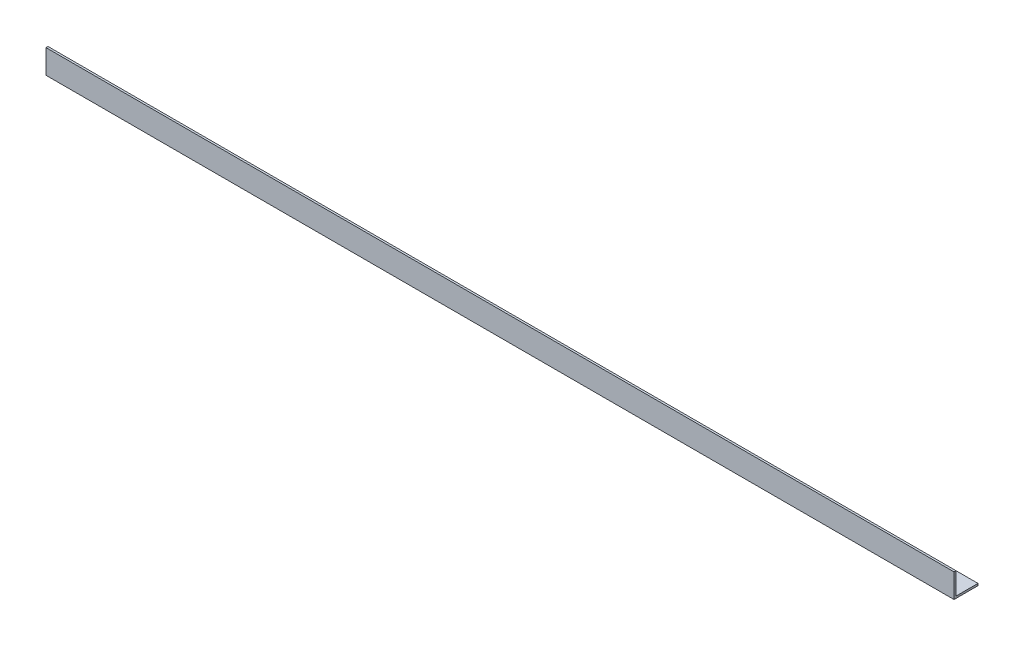
ISO-10303-21;
HEADER;
FILE_DESCRIPTION(('STEP AP214'),'2;1');
FILE_NAME('part.step','',(''),(''),'','','');
FILE_SCHEMA(('AUTOMOTIVE_DESIGN { 1 0 10303 214 1 1 1 1 }'));
ENDSEC;
DATA;
#1=APPLICATION_CONTEXT('core data for automotive mechanical design processes');
#2=APPLICATION_PROTOCOL_DEFINITION('international standard','automotive_design',2000,#1);
#3=PRODUCT_CONTEXT('',#1,'mechanical');
#4=PRODUCT('Part','Part','',(#3));
#5=PRODUCT_RELATED_PRODUCT_CATEGORY('part','',(#4));
#6=PRODUCT_DEFINITION_FORMATION('','',#4);
#7=PRODUCT_DEFINITION_CONTEXT('part definition',#1,'design');
#8=PRODUCT_DEFINITION('design','',#6,#7);
#9=PRODUCT_DEFINITION_SHAPE('','',#8);
#10=(LENGTH_UNIT() NAMED_UNIT(*) SI_UNIT(.MILLI.,.METRE.));
#11=(NAMED_UNIT(*) PLANE_ANGLE_UNIT() SI_UNIT($,.RADIAN.));
#12=(NAMED_UNIT(*) SI_UNIT($,.STERADIAN.) SOLID_ANGLE_UNIT());
#13=UNCERTAINTY_MEASURE_WITH_UNIT(LENGTH_MEASURE(1.E-05),#10,'distance_accuracy_value','');
#14=(GEOMETRIC_REPRESENTATION_CONTEXT(3) GLOBAL_UNCERTAINTY_ASSIGNED_CONTEXT((#13)) GLOBAL_UNIT_ASSIGNED_CONTEXT((#10,
#11,#12)) REPRESENTATION_CONTEXT('',''));
#15=CARTESIAN_POINT('',(0.,0.,0.));
#16=DIRECTION('',(0.,0.,1.));
#17=DIRECTION('',(1.,0.,0.));
#18=AXIS2_PLACEMENT_3D('',#15,#16,#17);
#19=CARTESIAN_POINT('',(720.852,0.,0.));
#20=DIRECTION('',(0.,1.,0.));
#21=DIRECTION('',(0.,0.,1.));
#22=AXIS2_PLACEMENT_3D('',#19,#20,#21);
#23=PLANE('',#22);
#24=DIRECTION('',(0.,0.,-1.));
#25=VECTOR('',#24,1.);
#26=CARTESIAN_POINT('',(0.,0.,0.));
#27=LINE('',#26,#25);
#28=CARTESIAN_POINT('',(0.,0.,0.));
#29=VERTEX_POINT('',#28);
#30=CARTESIAN_POINT('',(0.,0.,-19.05));
#31=VERTEX_POINT('',#30);
#32=EDGE_CURVE('E114',#29,#31,#27,.T.);
#33=ORIENTED_EDGE('',*,*,#32,.T.);
#34=DIRECTION('',(-1.,0.,0.));
#35=VECTOR('',#34,1.);
#36=CARTESIAN_POINT('',(720.852,0.,-19.05));
#37=LINE('',#36,#35);
#38=CARTESIAN_POINT('',(720.852,0.,-19.05));
#39=VERTEX_POINT('',#38);
#40=EDGE_CURVE('E11',#39,#31,#37,.T.);
#41=ORIENTED_EDGE('',*,*,#40,.F.);
#42=DIRECTION('',(0.,0.,-1.));
#43=VECTOR('',#42,1.);
#44=CARTESIAN_POINT('',(720.852,0.,0.));
#45=LINE('',#44,#43);
#46=CARTESIAN_POINT('',(720.852,0.,0.));
#47=VERTEX_POINT('',#46);
#48=EDGE_CURVE('E79',#47,#39,#45,.T.);
#49=ORIENTED_EDGE('',*,*,#48,.F.);
#50=DIRECTION('',(-1.,0.,0.));
#51=VECTOR('',#50,1.);
#52=CARTESIAN_POINT('',(720.852,0.,0.));
#53=LINE('',#52,#51);
#54=EDGE_CURVE('E110',#47,#29,#53,.T.);
#55=ORIENTED_EDGE('',*,*,#54,.T.);
#56=EDGE_LOOP('',(#33,#41,#49,#55));
#57=FACE_BOUND('',#56,.T.);
#58=ADVANCED_FACE('F33',(#57),#23,.F.);
#59=CARTESIAN_POINT('',(720.852,1.5875,-19.05));
#60=DIRECTION('',(0.,0.,-1.));
#61=DIRECTION('',(-1.,0.,0.));
#62=AXIS2_PLACEMENT_3D('',#59,#60,#61);
#63=PLANE('',#62);
#64=DIRECTION('',(0.,-1.,0.));
#65=VECTOR('',#64,1.);
#66=CARTESIAN_POINT('',(0.,1.5875,-19.05));
#67=LINE('',#66,#65);
#68=CARTESIAN_POINT('',(0.,1.5875,-19.05));
#69=VERTEX_POINT('',#68);
#70=EDGE_CURVE('E117',#69,#31,#67,.T.);
#71=ORIENTED_EDGE('',*,*,#70,.F.);
#72=DIRECTION('',(-1.,0.,0.));
#73=VECTOR('',#72,1.);
#74=CARTESIAN_POINT('',(720.852,1.5875,-19.05));
#75=LINE('',#74,#73);
#76=CARTESIAN_POINT('',(720.852,1.5875,-19.05));
#77=VERTEX_POINT('',#76);
#78=EDGE_CURVE('E41',#77,#69,#75,.T.);
#79=ORIENTED_EDGE('',*,*,#78,.F.);
#80=DIRECTION('',(0.,-1.,0.));
#81=VECTOR('',#80,1.);
#82=CARTESIAN_POINT('',(720.852,1.5875,-19.05));
#83=LINE('',#82,#81);
#84=EDGE_CURVE('E203',#77,#39,#83,.T.);
#85=ORIENTED_EDGE('',*,*,#84,.T.);
#86=ORIENTED_EDGE('',*,*,#40,.T.);
#87=EDGE_LOOP('',(#71,#79,#85,#86));
#88=FACE_BOUND('',#87,.T.);
#89=ADVANCED_FACE('F135',(#88),#63,.T.);
#90=CARTESIAN_POINT('',(720.852,1.5875,0.));
#91=DIRECTION('',(0.,1.,0.));
#92=DIRECTION('',(0.,0.,1.));
#93=AXIS2_PLACEMENT_3D('',#90,#91,#92);
#94=PLANE('',#93);
#95=DIRECTION('',(0.,0.,-1.));
#96=VECTOR('',#95,1.);
#97=CARTESIAN_POINT('',(0.,1.5875,0.));
#98=LINE('',#97,#96);
#99=CARTESIAN_POINT('',(0.,1.5875,-1.5875));
#100=VERTEX_POINT('',#99);
#101=EDGE_CURVE('E120',#100,#69,#98,.T.);
#102=ORIENTED_EDGE('',*,*,#101,.F.);
#103=DIRECTION('',(-1.,0.,0.));
#104=VECTOR('',#103,1.);
#105=CARTESIAN_POINT('',(720.852,1.5875,-1.5875));
#106=LINE('',#105,#104);
#107=CARTESIAN_POINT('',(720.852,1.5875,-1.5875));
#108=VERTEX_POINT('',#107);
#109=EDGE_CURVE('E100',#108,#100,#106,.T.);
#110=ORIENTED_EDGE('',*,*,#109,.F.);
#111=DIRECTION('',(0.,0.,-1.));
#112=VECTOR('',#111,1.);
#113=CARTESIAN_POINT('',(720.852,1.5875,0.));
#114=LINE('',#113,#112);
#115=EDGE_CURVE('E106',#108,#77,#114,.T.);
#116=ORIENTED_EDGE('',*,*,#115,.T.);
#117=ORIENTED_EDGE('',*,*,#78,.T.);
#118=EDGE_LOOP('',(#102,#110,#116,#117));
#119=FACE_BOUND('',#118,.T.);
#120=ADVANCED_FACE('F132',(#119),#94,.T.);
#121=CARTESIAN_POINT('',(720.852,19.05,-1.5875));
#122=DIRECTION('',(0.,0.,-1.));
#123=DIRECTION('',(0.,1.,0.));
#124=AXIS2_PLACEMENT_3D('',#121,#122,#123);
#125=PLANE('',#124);
#126=DIRECTION('',(0.,-1.,0.));
#127=VECTOR('',#126,1.);
#128=CARTESIAN_POINT('',(0.,19.05,-1.5875));
#129=LINE('',#128,#127);
#130=CARTESIAN_POINT('',(0.,19.05,-1.5875));
#131=VERTEX_POINT('',#130);
#132=EDGE_CURVE('E95',#131,#100,#129,.T.);
#133=ORIENTED_EDGE('',*,*,#132,.F.);
#134=DIRECTION('',(-1.,0.,0.));
#135=VECTOR('',#134,1.);
#136=CARTESIAN_POINT('',(720.852,19.05,-1.5875));
#137=LINE('',#136,#135);
#138=CARTESIAN_POINT('',(720.852,19.05,-1.5875));
#139=VERTEX_POINT('',#138);
#140=EDGE_CURVE('E90',#139,#131,#137,.T.);
#141=ORIENTED_EDGE('',*,*,#140,.F.);
#142=DIRECTION('',(0.,-1.,0.));
#143=VECTOR('',#142,1.);
#144=CARTESIAN_POINT('',(720.852,19.05,-1.5875));
#145=LINE('',#144,#143);
#146=EDGE_CURVE('E93',#139,#108,#145,.T.);
#147=ORIENTED_EDGE('',*,*,#146,.T.);
#148=ORIENTED_EDGE('',*,*,#109,.T.);
#149=EDGE_LOOP('',(#133,#141,#147,#148));
#150=FACE_BOUND('',#149,.T.);
#151=ADVANCED_FACE('F92',(#150),#125,.T.);
#152=CARTESIAN_POINT('',(720.852,19.05,0.));
#153=DIRECTION('',(0.,1.,0.));
#154=DIRECTION('',(0.,0.,1.));
#155=AXIS2_PLACEMENT_3D('',#152,#153,#154);
#156=PLANE('',#155);
#157=DIRECTION('',(0.,0.,-1.));
#158=VECTOR('',#157,1.);
#159=CARTESIAN_POINT('',(0.,19.05,0.));
#160=LINE('',#159,#158);
#161=CARTESIAN_POINT('',(0.,19.05,0.));
#162=VERTEX_POINT('',#161);
#163=EDGE_CURVE('E124',#162,#131,#160,.T.);
#164=ORIENTED_EDGE('',*,*,#163,.F.);
#165=DIRECTION('',(-1.,0.,0.));
#166=VECTOR('',#165,1.);
#167=CARTESIAN_POINT('',(720.852,19.05,0.));
#168=LINE('',#167,#166);
#169=CARTESIAN_POINT('',(720.852,19.05,0.));
#170=VERTEX_POINT('',#169);
#171=EDGE_CURVE('E70',#170,#162,#168,.T.);
#172=ORIENTED_EDGE('',*,*,#171,.F.);
#173=DIRECTION('',(0.,0.,-1.));
#174=VECTOR('',#173,1.);
#175=CARTESIAN_POINT('',(720.852,19.05,0.));
#176=LINE('',#175,#174);
#177=EDGE_CURVE('E104',#170,#139,#176,.T.);
#178=ORIENTED_EDGE('',*,*,#177,.T.);
#179=ORIENTED_EDGE('',*,*,#140,.T.);
#180=EDGE_LOOP('',(#164,#172,#178,#179));
#181=FACE_BOUND('',#180,.T.);
#182=ADVANCED_FACE('F108',(#181),#156,.T.);
#183=CARTESIAN_POINT('',(720.852,19.05,0.));
#184=DIRECTION('',(0.,0.,-1.));
#185=DIRECTION('',(0.,1.,0.));
#186=AXIS2_PLACEMENT_3D('',#183,#184,#185);
#187=PLANE('',#186);
#188=DIRECTION('',(0.,-1.,0.));
#189=VECTOR('',#188,1.);
#190=CARTESIAN_POINT('',(0.,19.05,0.));
#191=LINE('',#190,#189);
#192=EDGE_CURVE('E73',#162,#29,#191,.T.);
#193=ORIENTED_EDGE('',*,*,#192,.T.);
#194=ORIENTED_EDGE('',*,*,#54,.F.);
#195=DIRECTION('',(0.,-1.,0.));
#196=VECTOR('',#195,1.);
#197=CARTESIAN_POINT('',(720.852,19.05,0.));
#198=LINE('',#197,#196);
#199=EDGE_CURVE('E49',#170,#47,#198,.T.);
#200=ORIENTED_EDGE('',*,*,#199,.F.);
#201=ORIENTED_EDGE('',*,*,#171,.T.);
#202=EDGE_LOOP('',(#193,#194,#200,#201));
#203=FACE_BOUND('',#202,.T.);
#204=ADVANCED_FACE('F140',(#203),#187,.F.);
#205=CARTESIAN_POINT('',(720.852,0.,0.));
#206=DIRECTION('',(-1.,0.,0.));
#207=DIRECTION('',(0.,0.,1.));
#208=AXIS2_PLACEMENT_3D('',#205,#206,#207);
#209=PLANE('',#208);
#210=ORIENTED_EDGE('',*,*,#48,.T.);
#211=ORIENTED_EDGE('',*,*,#84,.F.);
#212=ORIENTED_EDGE('',*,*,#115,.F.);
#213=ORIENTED_EDGE('',*,*,#146,.F.);
#214=ORIENTED_EDGE('',*,*,#177,.F.);
#215=ORIENTED_EDGE('',*,*,#199,.T.);
#216=EDGE_LOOP('',(#210,#211,#212,#213,#214,#215));
#217=FACE_BOUND('',#216,.T.);
#218=ADVANCED_FACE('F103',(#217),#209,.F.);
#219=CARTESIAN_POINT('',(0.,0.,0.));
#220=DIRECTION('',(-1.,0.,0.));
#221=DIRECTION('',(0.,0.,1.));
#222=AXIS2_PLACEMENT_3D('',#219,#220,#221);
#223=PLANE('',#222);
#224=ORIENTED_EDGE('',*,*,#32,.F.);
#225=ORIENTED_EDGE('',*,*,#192,.F.);
#226=ORIENTED_EDGE('',*,*,#163,.T.);
#227=ORIENTED_EDGE('',*,*,#132,.T.);
#228=ORIENTED_EDGE('',*,*,#101,.T.);
#229=ORIENTED_EDGE('',*,*,#70,.T.);
#230=EDGE_LOOP('',(#224,#225,#226,#227,#228,#229));
#231=FACE_BOUND('',#230,.T.);
#232=ADVANCED_FACE('F138',(#231),#223,.T.);
#233=CLOSED_SHELL('',(#58,#89,#120,#151,#182,#204,#218,#232));
#234=MANIFOLD_SOLID_BREP('B2',#233);
#235=ADVANCED_BREP_SHAPE_REPRESENTATION('',(#18,#234),#14);
#236=SHAPE_DEFINITION_REPRESENTATION(#9,#235);
ENDSEC;
END-ISO-10303-21;
